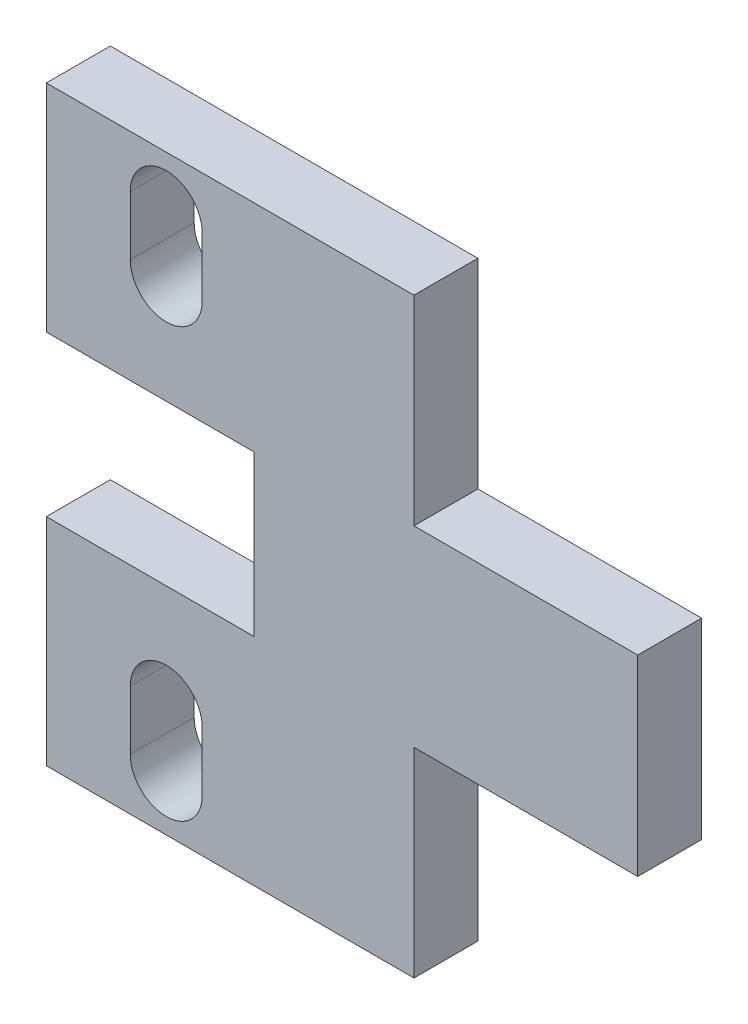
ISO-10303-21;
HEADER;
FILE_DESCRIPTION(('STEP AP214'),'2;1');
FILE_NAME('part.step','',(''),(''),'','','');
FILE_SCHEMA(('AUTOMOTIVE_DESIGN { 1 0 10303 214 1 1 1 1 }'));
ENDSEC;
DATA;
#1=APPLICATION_CONTEXT('core data for automotive mechanical design processes');
#2=APPLICATION_PROTOCOL_DEFINITION('international standard','automotive_design',2000,#1);
#3=PRODUCT_CONTEXT('',#1,'mechanical');
#4=PRODUCT('Part','Part','',(#3));
#5=PRODUCT_RELATED_PRODUCT_CATEGORY('part','',(#4));
#6=PRODUCT_DEFINITION_FORMATION('','',#4);
#7=PRODUCT_DEFINITION_CONTEXT('part definition',#1,'design');
#8=PRODUCT_DEFINITION('design','',#6,#7);
#9=PRODUCT_DEFINITION_SHAPE('','',#8);
#10=(LENGTH_UNIT() NAMED_UNIT(*) SI_UNIT(.MILLI.,.METRE.));
#11=(NAMED_UNIT(*) PLANE_ANGLE_UNIT() SI_UNIT($,.RADIAN.));
#12=(NAMED_UNIT(*) SI_UNIT($,.STERADIAN.) SOLID_ANGLE_UNIT());
#13=UNCERTAINTY_MEASURE_WITH_UNIT(LENGTH_MEASURE(1.E-05),#10,'distance_accuracy_value','');
#14=(GEOMETRIC_REPRESENTATION_CONTEXT(3) GLOBAL_UNCERTAINTY_ASSIGNED_CONTEXT((#13)) GLOBAL_UNIT_ASSIGNED_CONTEXT((#10,
#11,#12)) REPRESENTATION_CONTEXT('',''));
#15=CARTESIAN_POINT('',(0.,0.,0.));
#16=DIRECTION('',(0.,0.,1.));
#17=DIRECTION('',(1.,0.,0.));
#18=AXIS2_PLACEMENT_3D('',#15,#16,#17);
#19=CARTESIAN_POINT('',(0.,0.,2.));
#20=DIRECTION('',(0.,0.,1.));
#21=DIRECTION('',(1.,0.,0.));
#22=AXIS2_PLACEMENT_3D('',#19,#20,#21);
#23=PLANE('',#22);
#24=DIRECTION('',(0.,1.,0.));
#25=VECTOR('',#24,1.);
#26=CARTESIAN_POINT('',(-7.75,11.55,2.));
#27=LINE('',#26,#25);
#28=CARTESIAN_POINT('',(-7.74999999999997,11.55,2.));
#29=VERTEX_POINT('',#28);
#30=CARTESIAN_POINT('',(-7.75,15.25,2.));
#31=VERTEX_POINT('',#30);
#32=EDGE_CURVE('E331',#29,#31,#27,.T.);
#33=ORIENTED_EDGE('',*,*,#32,.T.);
#34=CARTESIAN_POINT('',(-5.5,15.25,2.));
#35=DIRECTION('',(0.,0.,1.));
#36=DIRECTION('',(1.,0.,0.));
#37=AXIS2_PLACEMENT_3D('',#34,#35,#36);
#38=CIRCLE('',#37,2.25);
#39=CARTESIAN_POINT('',(-3.24999999999995,15.25,2.));
#40=VERTEX_POINT('',#39);
#41=EDGE_CURVE('E342',#40,#31,#38,.T.);
#42=ORIENTED_EDGE('',*,*,#41,.F.);
#43=DIRECTION('',(0.,1.,0.));
#44=VECTOR('',#43,1.);
#45=CARTESIAN_POINT('',(-3.24999999999995,11.55,2.));
#46=LINE('',#45,#44);
#47=CARTESIAN_POINT('',(-3.25,11.55,2.));
#48=VERTEX_POINT('',#47);
#49=EDGE_CURVE('E325',#48,#40,#46,.T.);
#50=ORIENTED_EDGE('',*,*,#49,.F.);
#51=CARTESIAN_POINT('',(-5.5,11.55,2.));
#52=DIRECTION('',(0.,0.,1.));
#53=DIRECTION('',(1.,0.,0.));
#54=AXIS2_PLACEMENT_3D('',#51,#52,#53);
#55=CIRCLE('',#54,2.25);
#56=EDGE_CURVE('E329',#29,#48,#55,.T.);
#57=ORIENTED_EDGE('',*,*,#56,.F.);
#58=EDGE_LOOP('',(#33,#42,#50,#57));
#59=FACE_BOUND('',#58,.T.);
#60=DIRECTION('',(0.,1.,0.));
#61=VECTOR('',#60,1.);
#62=CARTESIAN_POINT('',(24.,-6.,2.));
#63=LINE('',#62,#61);
#64=CARTESIAN_POINT('',(24.,-6.,2.));
#65=VERTEX_POINT('',#64);
#66=CARTESIAN_POINT('',(24.,6.,2.));
#67=VERTEX_POINT('',#66);
#68=EDGE_CURVE('E438',#65,#67,#63,.T.);
#69=ORIENTED_EDGE('',*,*,#68,.T.);
#70=DIRECTION('',(1.,0.,0.));
#71=VECTOR('',#70,1.);
#72=CARTESIAN_POINT('',(10.,6.,2.));
#73=LINE('',#72,#71);
#74=CARTESIAN_POINT('',(10.,6.,2.));
#75=VERTEX_POINT('',#74);
#76=EDGE_CURVE('E350',#75,#67,#73,.T.);
#77=ORIENTED_EDGE('',*,*,#76,.F.);
#78=DIRECTION('',(0.,-1.,0.));
#79=VECTOR('',#78,1.);
#80=CARTESIAN_POINT('',(10.,18.5,2.));
#81=LINE('',#80,#79);
#82=CARTESIAN_POINT('',(10.,18.5,2.));
#83=VERTEX_POINT('',#82);
#84=EDGE_CURVE('E353',#83,#75,#81,.T.);
#85=ORIENTED_EDGE('',*,*,#84,.F.);
#86=DIRECTION('',(1.,0.,0.));
#87=VECTOR('',#86,1.);
#88=CARTESIAN_POINT('',(-13.,18.5,2.));
#89=LINE('',#88,#87);
#90=CARTESIAN_POINT('',(-13.,18.5,2.));
#91=VERTEX_POINT('',#90);
#92=EDGE_CURVE('E357',#91,#83,#89,.T.);
#93=ORIENTED_EDGE('',*,*,#92,.F.);
#94=DIRECTION('',(0.,1.,0.));
#95=VECTOR('',#94,1.);
#96=CARTESIAN_POINT('',(-13.,5.,2.));
#97=LINE('',#96,#95);
#98=CARTESIAN_POINT('',(-13.,5.,2.));
#99=VERTEX_POINT('',#98);
#100=EDGE_CURVE('E360',#99,#91,#97,.T.);
#101=ORIENTED_EDGE('',*,*,#100,.F.);
#102=DIRECTION('',(-1.,0.,0.));
#103=VECTOR('',#102,1.);
#104=CARTESIAN_POINT('',(0.,5.,2.));
#105=LINE('',#104,#103);
#106=CARTESIAN_POINT('',(0.,5.,2.));
#107=VERTEX_POINT('',#106);
#108=EDGE_CURVE('E363',#107,#99,#105,.T.);
#109=ORIENTED_EDGE('',*,*,#108,.F.);
#110=DIRECTION('',(0.,-1.,0.));
#111=VECTOR('',#110,1.);
#112=CARTESIAN_POINT('',(0.,0.,2.));
#113=LINE('',#112,#111);
#114=CARTESIAN_POINT('',(0.,-5.,2.));
#115=VERTEX_POINT('',#114);
#116=EDGE_CURVE('E425',#107,#115,#113,.T.);
#117=ORIENTED_EDGE('',*,*,#116,.T.);
#118=DIRECTION('',(-1.,0.,0.));
#119=VECTOR('',#118,1.);
#120=CARTESIAN_POINT('',(0.,-5.,2.));
#121=LINE('',#120,#119);
#122=CARTESIAN_POINT('',(-13.,-5.,2.));
#123=VERTEX_POINT('',#122);
#124=EDGE_CURVE('E427',#115,#123,#121,.T.);
#125=ORIENTED_EDGE('',*,*,#124,.T.);
#126=DIRECTION('',(0.,-1.,0.));
#127=VECTOR('',#126,1.);
#128=CARTESIAN_POINT('',(-13.,-5.,2.));
#129=LINE('',#128,#127);
#130=CARTESIAN_POINT('',(-13.,-18.5,2.));
#131=VERTEX_POINT('',#130);
#132=EDGE_CURVE('E430',#123,#131,#129,.T.);
#133=ORIENTED_EDGE('',*,*,#132,.T.);
#134=DIRECTION('',(1.,0.,0.));
#135=VECTOR('',#134,1.);
#136=CARTESIAN_POINT('',(-13.,-18.5,2.));
#137=LINE('',#136,#135);
#138=CARTESIAN_POINT('',(10.,-18.5,2.));
#139=VERTEX_POINT('',#138);
#140=EDGE_CURVE('E432',#131,#139,#137,.T.);
#141=ORIENTED_EDGE('',*,*,#140,.T.);
#142=DIRECTION('',(0.,1.,0.));
#143=VECTOR('',#142,1.);
#144=CARTESIAN_POINT('',(10.,-18.5,2.));
#145=LINE('',#144,#143);
#146=CARTESIAN_POINT('',(10.,-6.,2.));
#147=VERTEX_POINT('',#146);
#148=EDGE_CURVE('E434',#139,#147,#145,.T.);
#149=ORIENTED_EDGE('',*,*,#148,.T.);
#150=DIRECTION('',(1.,0.,0.));
#151=VECTOR('',#150,1.);
#152=CARTESIAN_POINT('',(10.,-6.,2.));
#153=LINE('',#152,#151);
#154=EDGE_CURVE('E436',#147,#65,#153,.T.);
#155=ORIENTED_EDGE('',*,*,#154,.T.);
#156=EDGE_LOOP('',(#69,#77,#85,#93,#101,#109,#117,#125,#133,#141,#149,#155));
#157=FACE_BOUND('',#156,.T.);
#158=CARTESIAN_POINT('',(-5.5,-11.55,2.));
#159=DIRECTION('',(0.,0.,1.));
#160=DIRECTION('',(1.,0.,0.));
#161=AXIS2_PLACEMENT_3D('',#158,#159,#160);
#162=CIRCLE('',#161,2.25);
#163=CARTESIAN_POINT('',(-3.25,-11.55,2.));
#164=VERTEX_POINT('',#163);
#165=CARTESIAN_POINT('',(-7.75,-11.55,2.));
#166=VERTEX_POINT('',#165);
#167=EDGE_CURVE('E407',#164,#166,#162,.T.);
#168=ORIENTED_EDGE('',*,*,#167,.F.);
#169=DIRECTION('',(0.,-1.,0.));
#170=VECTOR('',#169,1.);
#171=CARTESIAN_POINT('',(-3.25,-11.55,2.));
#172=LINE('',#171,#170);
#173=CARTESIAN_POINT('',(-3.25,-15.25,2.));
#174=VERTEX_POINT('',#173);
#175=EDGE_CURVE('E401',#164,#174,#172,.T.);
#176=ORIENTED_EDGE('',*,*,#175,.T.);
#177=CARTESIAN_POINT('',(-5.5,-15.25,2.));
#178=DIRECTION('',(0.,0.,1.));
#179=DIRECTION('',(1.,0.,0.));
#180=AXIS2_PLACEMENT_3D('',#177,#178,#179);
#181=CIRCLE('',#180,2.25);
#182=CARTESIAN_POINT('',(-7.75000000000006,-15.25,2.));
#183=VERTEX_POINT('',#182);
#184=EDGE_CURVE('E417',#183,#174,#181,.T.);
#185=ORIENTED_EDGE('',*,*,#184,.F.);
#186=DIRECTION('',(0.,-1.,0.));
#187=VECTOR('',#186,1.);
#188=CARTESIAN_POINT('',(-7.75000000000006,-11.55,2.));
#189=LINE('',#188,#187);
#190=EDGE_CURVE('E393',#166,#183,#189,.T.);
#191=ORIENTED_EDGE('',*,*,#190,.F.);
#192=EDGE_LOOP('',(#168,#176,#185,#191));
#193=FACE_BOUND('',#192,.T.);
#194=ADVANCED_FACE('F181',(#59,#157,#193),#23,.T.);
#195=CARTESIAN_POINT('',(0.,0.,2.));
#196=DIRECTION('',(1.,0.,0.));
#197=DIRECTION('',(0.,1.,0.));
#198=AXIS2_PLACEMENT_3D('',#195,#196,#197);
#199=PLANE('',#198);
#200=DIRECTION('',(0.,-1.,0.));
#201=VECTOR('',#200,1.);
#202=CARTESIAN_POINT('',(0.,0.,-2.));
#203=LINE('',#202,#201);
#204=CARTESIAN_POINT('',(0.,5.,-2.));
#205=VERTEX_POINT('',#204);
#206=CARTESIAN_POINT('',(0.,-5.,-2.));
#207=VERTEX_POINT('',#206);
#208=EDGE_CURVE('E424',#205,#207,#203,.T.);
#209=ORIENTED_EDGE('',*,*,#208,.T.);
#210=DIRECTION('',(0.,0.,-1.));
#211=VECTOR('',#210,1.);
#212=CARTESIAN_POINT('',(0.,-5.,2.));
#213=LINE('',#212,#211);
#214=EDGE_CURVE('E13',#115,#207,#213,.T.);
#215=ORIENTED_EDGE('',*,*,#214,.F.);
#216=ORIENTED_EDGE('',*,*,#116,.F.);
#217=DIRECTION('',(0.,0.,-1.));
#218=VECTOR('',#217,1.);
#219=CARTESIAN_POINT('',(0.,5.,2.));
#220=LINE('',#219,#218);
#221=EDGE_CURVE('E366',#107,#205,#220,.T.);
#222=ORIENTED_EDGE('',*,*,#221,.T.);
#223=EDGE_LOOP('',(#209,#215,#216,#222));
#224=FACE_BOUND('',#223,.T.);
#225=ADVANCED_FACE('F183',(#224),#199,.F.);
#226=CARTESIAN_POINT('',(0.,-5.,2.));
#227=DIRECTION('',(0.,-1.,0.));
#228=DIRECTION('',(1.,0.,0.));
#229=AXIS2_PLACEMENT_3D('',#226,#227,#228);
#230=PLANE('',#229);
#231=DIRECTION('',(-1.,0.,0.));
#232=VECTOR('',#231,1.);
#233=CARTESIAN_POINT('',(0.,-5.,-2.));
#234=LINE('',#233,#232);
#235=CARTESIAN_POINT('',(-13.,-5.,-2.));
#236=VERTEX_POINT('',#235);
#237=EDGE_CURVE('E442',#207,#236,#234,.T.);
#238=ORIENTED_EDGE('',*,*,#237,.T.);
#239=DIRECTION('',(0.,0.,-1.));
#240=VECTOR('',#239,1.);
#241=CARTESIAN_POINT('',(-13.,-5.,2.));
#242=LINE('',#241,#240);
#243=EDGE_CURVE('E189',#123,#236,#242,.T.);
#244=ORIENTED_EDGE('',*,*,#243,.F.);
#245=ORIENTED_EDGE('',*,*,#124,.F.);
#246=ORIENTED_EDGE('',*,*,#214,.T.);
#247=EDGE_LOOP('',(#238,#244,#245,#246));
#248=FACE_BOUND('',#247,.T.);
#249=ADVANCED_FACE('F491',(#248),#230,.F.);
#250=CARTESIAN_POINT('',(-13.,-5.,2.));
#251=DIRECTION('',(1.,0.,0.));
#252=DIRECTION('',(0.,1.,0.));
#253=AXIS2_PLACEMENT_3D('',#250,#251,#252);
#254=PLANE('',#253);
#255=DIRECTION('',(0.,-1.,0.));
#256=VECTOR('',#255,1.);
#257=CARTESIAN_POINT('',(-13.,-5.,-2.));
#258=LINE('',#257,#256);
#259=CARTESIAN_POINT('',(-13.,-18.5,-2.));
#260=VERTEX_POINT('',#259);
#261=EDGE_CURVE('E444',#236,#260,#258,.T.);
#262=ORIENTED_EDGE('',*,*,#261,.T.);
#263=DIRECTION('',(0.,0.,-1.));
#264=VECTOR('',#263,1.);
#265=CARTESIAN_POINT('',(-13.,-18.5,2.));
#266=LINE('',#265,#264);
#267=EDGE_CURVE('E461',#131,#260,#266,.T.);
#268=ORIENTED_EDGE('',*,*,#267,.F.);
#269=ORIENTED_EDGE('',*,*,#132,.F.);
#270=ORIENTED_EDGE('',*,*,#243,.T.);
#271=EDGE_LOOP('',(#262,#268,#269,#270));
#272=FACE_BOUND('',#271,.T.);
#273=ADVANCED_FACE('F468',(#272),#254,.F.);
#274=CARTESIAN_POINT('',(-13.,-18.5,2.));
#275=DIRECTION('',(0.,1.,0.));
#276=DIRECTION('',(-1.,0.,0.));
#277=AXIS2_PLACEMENT_3D('',#274,#275,#276);
#278=PLANE('',#277);
#279=DIRECTION('',(1.,0.,0.));
#280=VECTOR('',#279,1.);
#281=CARTESIAN_POINT('',(-13.,-18.5,-2.));
#282=LINE('',#281,#280);
#283=CARTESIAN_POINT('',(10.,-18.5,-2.));
#284=VERTEX_POINT('',#283);
#285=EDGE_CURVE('E446',#260,#284,#282,.T.);
#286=ORIENTED_EDGE('',*,*,#285,.T.);
#287=DIRECTION('',(0.,0.,-1.));
#288=VECTOR('',#287,1.);
#289=CARTESIAN_POINT('',(10.,-18.5,2.));
#290=LINE('',#289,#288);
#291=EDGE_CURVE('E458',#139,#284,#290,.T.);
#292=ORIENTED_EDGE('',*,*,#291,.F.);
#293=ORIENTED_EDGE('',*,*,#140,.F.);
#294=ORIENTED_EDGE('',*,*,#267,.T.);
#295=EDGE_LOOP('',(#286,#292,#293,#294));
#296=FACE_BOUND('',#295,.T.);
#297=ADVANCED_FACE('F479',(#296),#278,.F.);
#298=CARTESIAN_POINT('',(10.,-18.5,2.));
#299=DIRECTION('',(-1.,0.,0.));
#300=DIRECTION('',(0.,-1.,0.));
#301=AXIS2_PLACEMENT_3D('',#298,#299,#300);
#302=PLANE('',#301);
#303=DIRECTION('',(0.,1.,0.));
#304=VECTOR('',#303,1.);
#305=CARTESIAN_POINT('',(10.,-18.5,-2.));
#306=LINE('',#305,#304);
#307=CARTESIAN_POINT('',(10.,-6.,-2.));
#308=VERTEX_POINT('',#307);
#309=EDGE_CURVE('E448',#284,#308,#306,.T.);
#310=ORIENTED_EDGE('',*,*,#309,.T.);
#311=DIRECTION('',(0.,0.,-1.));
#312=VECTOR('',#311,1.);
#313=CARTESIAN_POINT('',(10.,-6.,2.));
#314=LINE('',#313,#312);
#315=EDGE_CURVE('E455',#147,#308,#314,.T.);
#316=ORIENTED_EDGE('',*,*,#315,.F.);
#317=ORIENTED_EDGE('',*,*,#148,.F.);
#318=ORIENTED_EDGE('',*,*,#291,.T.);
#319=EDGE_LOOP('',(#310,#316,#317,#318));
#320=FACE_BOUND('',#319,.T.);
#321=ADVANCED_FACE('F483',(#320),#302,.F.);
#322=CARTESIAN_POINT('',(10.,-6.,2.));
#323=DIRECTION('',(0.,1.,0.));
#324=DIRECTION('',(-1.,0.,0.));
#325=AXIS2_PLACEMENT_3D('',#322,#323,#324);
#326=PLANE('',#325);
#327=DIRECTION('',(1.,0.,0.));
#328=VECTOR('',#327,1.);
#329=CARTESIAN_POINT('',(10.,-6.,-2.));
#330=LINE('',#329,#328);
#331=CARTESIAN_POINT('',(24.,-6.,-2.));
#332=VERTEX_POINT('',#331);
#333=EDGE_CURVE('E450',#308,#332,#330,.T.);
#334=ORIENTED_EDGE('',*,*,#333,.T.);
#335=DIRECTION('',(0.,0.,-1.));
#336=VECTOR('',#335,1.);
#337=CARTESIAN_POINT('',(24.,-6.,2.));
#338=LINE('',#337,#336);
#339=EDGE_CURVE('E440',#65,#332,#338,.T.);
#340=ORIENTED_EDGE('',*,*,#339,.F.);
#341=ORIENTED_EDGE('',*,*,#154,.F.);
#342=ORIENTED_EDGE('',*,*,#315,.T.);
#343=EDGE_LOOP('',(#334,#340,#341,#342));
#344=FACE_BOUND('',#343,.T.);
#345=ADVANCED_FACE('F519',(#344),#326,.F.);
#346=CARTESIAN_POINT('',(24.,-6.,2.));
#347=DIRECTION('',(-1.,0.,0.));
#348=DIRECTION('',(0.,0.,1.));
#349=AXIS2_PLACEMENT_3D('',#346,#347,#348);
#350=PLANE('',#349);
#351=DIRECTION('',(0.,1.,0.));
#352=VECTOR('',#351,1.);
#353=CARTESIAN_POINT('',(24.,-6.,-2.));
#354=LINE('',#353,#352);
#355=CARTESIAN_POINT('',(24.,6.,-2.));
#356=VERTEX_POINT('',#355);
#357=EDGE_CURVE('E428',#332,#356,#354,.T.);
#358=ORIENTED_EDGE('',*,*,#357,.T.);
#359=DIRECTION('',(0.,0.,-1.));
#360=VECTOR('',#359,1.);
#361=CARTESIAN_POINT('',(24.,6.,2.));
#362=LINE('',#361,#360);
#363=EDGE_CURVE('E390',#67,#356,#362,.T.);
#364=ORIENTED_EDGE('',*,*,#363,.F.);
#365=ORIENTED_EDGE('',*,*,#68,.F.);
#366=ORIENTED_EDGE('',*,*,#339,.T.);
#367=EDGE_LOOP('',(#358,#364,#365,#366));
#368=FACE_BOUND('',#367,.T.);
#369=ADVANCED_FACE('F517',(#368),#350,.F.);
#370=CARTESIAN_POINT('',(0.,0.,-2.));
#371=DIRECTION('',(0.,0.,1.));
#372=DIRECTION('',(1.,0.,0.));
#373=AXIS2_PLACEMENT_3D('',#370,#371,#372);
#374=PLANE('',#373);
#375=CARTESIAN_POINT('',(-5.5,11.55,-2.));
#376=DIRECTION('',(0.,0.,1.));
#377=DIRECTION('',(1.,0.,0.));
#378=AXIS2_PLACEMENT_3D('',#375,#376,#377);
#379=CIRCLE('',#378,2.25);
#380=CARTESIAN_POINT('',(-7.75,11.55,-2.));
#381=VERTEX_POINT('',#380);
#382=CARTESIAN_POINT('',(-3.25,11.55,-2.));
#383=VERTEX_POINT('',#382);
#384=EDGE_CURVE('E203',#381,#383,#379,.T.);
#385=ORIENTED_EDGE('',*,*,#384,.T.);
#386=DIRECTION('',(0.,1.,0.));
#387=VECTOR('',#386,1.);
#388=CARTESIAN_POINT('',(-3.25,11.55,-2.));
#389=LINE('',#388,#387);
#390=CARTESIAN_POINT('',(-3.25,15.25,-2.));
#391=VERTEX_POINT('',#390);
#392=EDGE_CURVE('E318',#383,#391,#389,.T.);
#393=ORIENTED_EDGE('',*,*,#392,.T.);
#394=CARTESIAN_POINT('',(-5.5,15.25,-2.));
#395=DIRECTION('',(0.,0.,1.));
#396=DIRECTION('',(1.,0.,0.));
#397=AXIS2_PLACEMENT_3D('',#394,#395,#396);
#398=CIRCLE('',#397,2.25);
#399=CARTESIAN_POINT('',(-7.75,15.25,-2.));
#400=VERTEX_POINT('',#399);
#401=EDGE_CURVE('E345',#391,#400,#398,.T.);
#402=ORIENTED_EDGE('',*,*,#401,.T.);
#403=DIRECTION('',(0.,1.,0.));
#404=VECTOR('',#403,1.);
#405=CARTESIAN_POINT('',(-7.75,11.55,-2.));
#406=LINE('',#405,#404);
#407=EDGE_CURVE('E324',#381,#400,#406,.T.);
#408=ORIENTED_EDGE('',*,*,#407,.F.);
#409=EDGE_LOOP('',(#385,#393,#402,#408));
#410=FACE_BOUND('',#409,.T.);
#411=DIRECTION('',(0.,-1.,0.));
#412=VECTOR('',#411,1.);
#413=CARTESIAN_POINT('',(-7.75,-11.55,-2.));
#414=LINE('',#413,#412);
#415=CARTESIAN_POINT('',(-7.75,-11.55,-2.));
#416=VERTEX_POINT('',#415);
#417=CARTESIAN_POINT('',(-7.75,-15.25,-2.));
#418=VERTEX_POINT('',#417);
#419=EDGE_CURVE('E395',#416,#418,#414,.T.);
#420=ORIENTED_EDGE('',*,*,#419,.T.);
#421=CARTESIAN_POINT('',(-5.5,-15.25,-2.));
#422=DIRECTION('',(0.,0.,1.));
#423=DIRECTION('',(1.,0.,0.));
#424=AXIS2_PLACEMENT_3D('',#421,#422,#423);
#425=CIRCLE('',#424,2.25);
#426=CARTESIAN_POINT('',(-3.25,-15.25,-2.));
#427=VERTEX_POINT('',#426);
#428=EDGE_CURVE('E419',#418,#427,#425,.T.);
#429=ORIENTED_EDGE('',*,*,#428,.T.);
#430=DIRECTION('',(0.,-1.,0.));
#431=VECTOR('',#430,1.);
#432=CARTESIAN_POINT('',(-3.25,-11.55,-2.));
#433=LINE('',#432,#431);
#434=CARTESIAN_POINT('',(-3.25,-11.55,-2.));
#435=VERTEX_POINT('',#434);
#436=EDGE_CURVE('E398',#435,#427,#433,.T.);
#437=ORIENTED_EDGE('',*,*,#436,.F.);
#438=CARTESIAN_POINT('',(-5.5,-11.55,-2.));
#439=DIRECTION('',(0.,0.,1.));
#440=DIRECTION('',(1.,0.,0.));
#441=AXIS2_PLACEMENT_3D('',#438,#439,#440);
#442=CIRCLE('',#441,2.25);
#443=EDGE_CURVE('E409',#435,#416,#442,.T.);
#444=ORIENTED_EDGE('',*,*,#443,.T.);
#445=EDGE_LOOP('',(#420,#429,#437,#444));
#446=FACE_BOUND('',#445,.T.);
#447=ORIENTED_EDGE('',*,*,#208,.F.);
#448=DIRECTION('',(-1.,0.,0.));
#449=VECTOR('',#448,1.);
#450=CARTESIAN_POINT('',(0.,5.,-2.));
#451=LINE('',#450,#449);
#452=CARTESIAN_POINT('',(-13.,5.,-2.));
#453=VERTEX_POINT('',#452);
#454=EDGE_CURVE('E354',#205,#453,#451,.T.);
#455=ORIENTED_EDGE('',*,*,#454,.T.);
#456=DIRECTION('',(0.,1.,0.));
#457=VECTOR('',#456,1.);
#458=CARTESIAN_POINT('',(-13.,5.,-2.));
#459=LINE('',#458,#457);
#460=CARTESIAN_POINT('',(-13.,18.5,-2.));
#461=VERTEX_POINT('',#460);
#462=EDGE_CURVE('E375',#453,#461,#459,.T.);
#463=ORIENTED_EDGE('',*,*,#462,.T.);
#464=DIRECTION('',(1.,0.,0.));
#465=VECTOR('',#464,1.);
#466=CARTESIAN_POINT('',(-13.,18.5,-2.));
#467=LINE('',#466,#465);
#468=CARTESIAN_POINT('',(10.,18.5,-2.));
#469=VERTEX_POINT('',#468);
#470=EDGE_CURVE('E372',#461,#469,#467,.T.);
#471=ORIENTED_EDGE('',*,*,#470,.T.);
#472=DIRECTION('',(0.,-1.,0.));
#473=VECTOR('',#472,1.);
#474=CARTESIAN_POINT('',(10.,18.5,-2.));
#475=LINE('',#474,#473);
#476=CARTESIAN_POINT('',(10.,6.,-2.));
#477=VERTEX_POINT('',#476);
#478=EDGE_CURVE('E369',#469,#477,#475,.T.);
#479=ORIENTED_EDGE('',*,*,#478,.T.);
#480=DIRECTION('',(1.,0.,0.));
#481=VECTOR('',#480,1.);
#482=CARTESIAN_POINT('',(10.,6.,-2.));
#483=LINE('',#482,#481);
#484=EDGE_CURVE('E349',#477,#356,#483,.T.);
#485=ORIENTED_EDGE('',*,*,#484,.T.);
#486=ORIENTED_EDGE('',*,*,#357,.F.);
#487=ORIENTED_EDGE('',*,*,#333,.F.);
#488=ORIENTED_EDGE('',*,*,#309,.F.);
#489=ORIENTED_EDGE('',*,*,#285,.F.);
#490=ORIENTED_EDGE('',*,*,#261,.F.);
#491=ORIENTED_EDGE('',*,*,#237,.F.);
#492=EDGE_LOOP('',(#447,#455,#463,#471,#479,#485,#486,#487,#488,#489,#490,#491));
#493=FACE_BOUND('',#492,.T.);
#494=ADVANCED_FACE('F334',(#410,#446,#493),#374,.F.);
#495=CARTESIAN_POINT('',(-5.5,-15.25,2.));
#496=DIRECTION('',(0.,0.,1.));
#497=DIRECTION('',(1.,0.,0.));
#498=AXIS2_PLACEMENT_3D('',#495,#496,#497);
#499=CYLINDRICAL_SURFACE('',#498,2.25);
#500=ORIENTED_EDGE('',*,*,#184,.T.);
#501=DIRECTION('',(0.,0.,-1.));
#502=VECTOR('',#501,1.);
#503=CARTESIAN_POINT('',(-3.25,-15.25,-2.));
#504=LINE('',#503,#502);
#505=EDGE_CURVE('E415',#174,#427,#504,.T.);
#506=ORIENTED_EDGE('',*,*,#505,.T.);
#507=ORIENTED_EDGE('',*,*,#428,.F.);
#508=DIRECTION('',(0.,0.,1.));
#509=VECTOR('',#508,1.);
#510=CARTESIAN_POINT('',(-7.75,-15.25,2.));
#511=LINE('',#510,#509);
#512=EDGE_CURVE('E422',#183,#418,#511,.F.);
#513=ORIENTED_EDGE('',*,*,#512,.F.);
#514=EDGE_LOOP('',(#500,#506,#507,#513));
#515=FACE_BOUND('',#514,.T.);
#516=ADVANCED_FACE('F537',(#515),#499,.F.);
#517=CARTESIAN_POINT('',(-5.5,-11.55,2.));
#518=DIRECTION('',(0.,0.,1.));
#519=DIRECTION('',(1.,0.,0.));
#520=AXIS2_PLACEMENT_3D('',#517,#518,#519);
#521=CYLINDRICAL_SURFACE('',#520,2.25);
#522=ORIENTED_EDGE('',*,*,#443,.F.);
#523=DIRECTION('',(0.,0.,-1.));
#524=VECTOR('',#523,1.);
#525=CARTESIAN_POINT('',(-3.25,-11.55,-2.));
#526=LINE('',#525,#524);
#527=EDGE_CURVE('E404',#164,#435,#526,.T.);
#528=ORIENTED_EDGE('',*,*,#527,.F.);
#529=ORIENTED_EDGE('',*,*,#167,.T.);
#530=DIRECTION('',(0.,0.,1.));
#531=VECTOR('',#530,1.);
#532=CARTESIAN_POINT('',(-7.75,-11.55,2.));
#533=LINE('',#532,#531);
#534=EDGE_CURVE('E412',#416,#166,#533,.T.);
#535=ORIENTED_EDGE('',*,*,#534,.F.);
#536=EDGE_LOOP('',(#522,#528,#529,#535));
#537=FACE_BOUND('',#536,.T.);
#538=ADVANCED_FACE('F543',(#537),#521,.F.);
#539=CARTESIAN_POINT('',(-3.25,-11.55,-2.));
#540=DIRECTION('',(-1.,0.,0.));
#541=DIRECTION('',(0.,0.,1.));
#542=AXIS2_PLACEMENT_3D('',#539,#540,#541);
#543=PLANE('',#542);
#544=ORIENTED_EDGE('',*,*,#505,.F.);
#545=ORIENTED_EDGE('',*,*,#175,.F.);
#546=ORIENTED_EDGE('',*,*,#527,.T.);
#547=ORIENTED_EDGE('',*,*,#436,.T.);
#548=EDGE_LOOP('',(#544,#545,#546,#547));
#549=FACE_BOUND('',#548,.T.);
#550=ADVANCED_FACE('F548',(#549),#543,.T.);
#551=CARTESIAN_POINT('',(-7.75,-11.55,2.));
#552=DIRECTION('',(-1.,0.,0.));
#553=DIRECTION('',(0.,0.,1.));
#554=AXIS2_PLACEMENT_3D('',#551,#552,#553);
#555=PLANE('',#554);
#556=ORIENTED_EDGE('',*,*,#512,.T.);
#557=ORIENTED_EDGE('',*,*,#419,.F.);
#558=ORIENTED_EDGE('',*,*,#534,.T.);
#559=ORIENTED_EDGE('',*,*,#190,.T.);
#560=EDGE_LOOP('',(#556,#557,#558,#559));
#561=FACE_BOUND('',#560,.T.);
#562=ADVANCED_FACE('F561',(#561),#555,.F.);
#563=CARTESIAN_POINT('',(10.,6.,2.));
#564=DIRECTION('',(0.,1.,0.));
#565=DIRECTION('',(-1.,0.,0.));
#566=AXIS2_PLACEMENT_3D('',#563,#564,#565);
#567=PLANE('',#566);
#568=ORIENTED_EDGE('',*,*,#484,.F.);
#569=DIRECTION('',(0.,0.,-1.));
#570=VECTOR('',#569,1.);
#571=CARTESIAN_POINT('',(10.,6.,2.));
#572=LINE('',#571,#570);
#573=EDGE_CURVE('E388',#75,#477,#572,.T.);
#574=ORIENTED_EDGE('',*,*,#573,.F.);
#575=ORIENTED_EDGE('',*,*,#76,.T.);
#576=ORIENTED_EDGE('',*,*,#363,.T.);
#577=EDGE_LOOP('',(#568,#574,#575,#576));
#578=FACE_BOUND('',#577,.T.);
#579=ADVANCED_FACE('F513',(#578),#567,.T.);
#580=CARTESIAN_POINT('',(10.,18.5,2.));
#581=DIRECTION('',(1.,0.,0.));
#582=DIRECTION('',(0.,1.,0.));
#583=AXIS2_PLACEMENT_3D('',#580,#581,#582);
#584=PLANE('',#583);
#585=ORIENTED_EDGE('',*,*,#478,.F.);
#586=DIRECTION('',(0.,0.,-1.));
#587=VECTOR('',#586,1.);
#588=CARTESIAN_POINT('',(10.,18.5,2.));
#589=LINE('',#588,#587);
#590=EDGE_CURVE('E386',#83,#469,#589,.T.);
#591=ORIENTED_EDGE('',*,*,#590,.F.);
#592=ORIENTED_EDGE('',*,*,#84,.T.);
#593=ORIENTED_EDGE('',*,*,#573,.T.);
#594=EDGE_LOOP('',(#585,#591,#592,#593));
#595=FACE_BOUND('',#594,.T.);
#596=ADVANCED_FACE('F509',(#595),#584,.T.);
#597=CARTESIAN_POINT('',(-13.,18.5,2.));
#598=DIRECTION('',(0.,1.,0.));
#599=DIRECTION('',(-1.,0.,0.));
#600=AXIS2_PLACEMENT_3D('',#597,#598,#599);
#601=PLANE('',#600);
#602=ORIENTED_EDGE('',*,*,#470,.F.);
#603=DIRECTION('',(0.,0.,-1.));
#604=VECTOR('',#603,1.);
#605=CARTESIAN_POINT('',(-13.,18.5,2.));
#606=LINE('',#605,#604);
#607=EDGE_CURVE('E384',#91,#461,#606,.T.);
#608=ORIENTED_EDGE('',*,*,#607,.F.);
#609=ORIENTED_EDGE('',*,*,#92,.T.);
#610=ORIENTED_EDGE('',*,*,#590,.T.);
#611=EDGE_LOOP('',(#602,#608,#609,#610));
#612=FACE_BOUND('',#611,.T.);
#613=ADVANCED_FACE('F504',(#612),#601,.T.);
#614=CARTESIAN_POINT('',(-13.,5.,2.));
#615=DIRECTION('',(-1.,0.,0.));
#616=DIRECTION('',(0.,-1.,0.));
#617=AXIS2_PLACEMENT_3D('',#614,#615,#616);
#618=PLANE('',#617);
#619=ORIENTED_EDGE('',*,*,#462,.F.);
#620=DIRECTION('',(0.,0.,-1.));
#621=VECTOR('',#620,1.);
#622=CARTESIAN_POINT('',(-13.,5.,2.));
#623=LINE('',#622,#621);
#624=EDGE_CURVE('E382',#99,#453,#623,.T.);
#625=ORIENTED_EDGE('',*,*,#624,.F.);
#626=ORIENTED_EDGE('',*,*,#100,.T.);
#627=ORIENTED_EDGE('',*,*,#607,.T.);
#628=EDGE_LOOP('',(#619,#625,#626,#627));
#629=FACE_BOUND('',#628,.T.);
#630=ADVANCED_FACE('F500',(#629),#618,.T.);
#631=CARTESIAN_POINT('',(0.,5.,2.));
#632=DIRECTION('',(0.,-1.,0.));
#633=DIRECTION('',(1.,0.,0.));
#634=AXIS2_PLACEMENT_3D('',#631,#632,#633);
#635=PLANE('',#634);
#636=ORIENTED_EDGE('',*,*,#454,.F.);
#637=ORIENTED_EDGE('',*,*,#221,.F.);
#638=ORIENTED_EDGE('',*,*,#108,.T.);
#639=ORIENTED_EDGE('',*,*,#624,.T.);
#640=EDGE_LOOP('',(#636,#637,#638,#639));
#641=FACE_BOUND('',#640,.T.);
#642=ADVANCED_FACE('F497',(#641),#635,.T.);
#643=CARTESIAN_POINT('',(-5.5,15.25,2.));
#644=DIRECTION('',(0.,0.,1.));
#645=DIRECTION('',(1.,0.,0.));
#646=AXIS2_PLACEMENT_3D('',#643,#644,#645);
#647=CYLINDRICAL_SURFACE('',#646,2.25);
#648=ORIENTED_EDGE('',*,*,#401,.F.);
#649=DIRECTION('',(0.,0.,-1.));
#650=VECTOR('',#649,1.);
#651=CARTESIAN_POINT('',(-3.25,15.25,-2.));
#652=LINE('',#651,#650);
#653=EDGE_CURVE('E321',#40,#391,#652,.T.);
#654=ORIENTED_EDGE('',*,*,#653,.F.);
#655=ORIENTED_EDGE('',*,*,#41,.T.);
#656=DIRECTION('',(0.,0.,1.));
#657=VECTOR('',#656,1.);
#658=CARTESIAN_POINT('',(-7.75,15.25,2.));
#659=LINE('',#658,#657);
#660=EDGE_CURVE('E347',#400,#31,#659,.T.);
#661=ORIENTED_EDGE('',*,*,#660,.F.);
#662=EDGE_LOOP('',(#648,#654,#655,#661));
#663=FACE_BOUND('',#662,.T.);
#664=ADVANCED_FACE('F579',(#663),#647,.F.);
#665=CARTESIAN_POINT('',(-5.5,11.55,2.));
#666=DIRECTION('',(0.,0.,1.));
#667=DIRECTION('',(1.,0.,0.));
#668=AXIS2_PLACEMENT_3D('',#665,#666,#667);
#669=CYLINDRICAL_SURFACE('',#668,2.25);
#670=ORIENTED_EDGE('',*,*,#56,.T.);
#671=DIRECTION('',(0.,0.,-1.));
#672=VECTOR('',#671,1.);
#673=CARTESIAN_POINT('',(-3.25,11.55,-2.));
#674=LINE('',#673,#672);
#675=EDGE_CURVE('E196',#48,#383,#674,.T.);
#676=ORIENTED_EDGE('',*,*,#675,.T.);
#677=ORIENTED_EDGE('',*,*,#384,.F.);
#678=DIRECTION('',(0.,0.,1.));
#679=VECTOR('',#678,1.);
#680=CARTESIAN_POINT('',(-7.75,11.55,2.));
#681=LINE('',#680,#679);
#682=EDGE_CURVE('E336',#29,#381,#681,.F.);
#683=ORIENTED_EDGE('',*,*,#682,.F.);
#684=EDGE_LOOP('',(#670,#676,#677,#683));
#685=FACE_BOUND('',#684,.T.);
#686=ADVANCED_FACE('F327',(#685),#669,.F.);
#687=CARTESIAN_POINT('',(-7.75,11.55,2.));
#688=DIRECTION('',(-1.,0.,0.));
#689=DIRECTION('',(0.,0.,1.));
#690=AXIS2_PLACEMENT_3D('',#687,#688,#689);
#691=PLANE('',#690);
#692=ORIENTED_EDGE('',*,*,#660,.T.);
#693=ORIENTED_EDGE('',*,*,#32,.F.);
#694=ORIENTED_EDGE('',*,*,#682,.T.);
#695=ORIENTED_EDGE('',*,*,#407,.T.);
#696=EDGE_LOOP('',(#692,#693,#694,#695));
#697=FACE_BOUND('',#696,.T.);
#698=ADVANCED_FACE('F585',(#697),#691,.F.);
#699=CARTESIAN_POINT('',(-3.25,11.55,-2.));
#700=DIRECTION('',(1.,0.,0.));
#701=DIRECTION('',(0.,0.,-1.));
#702=AXIS2_PLACEMENT_3D('',#699,#700,#701);
#703=PLANE('',#702);
#704=ORIENTED_EDGE('',*,*,#653,.T.);
#705=ORIENTED_EDGE('',*,*,#392,.F.);
#706=ORIENTED_EDGE('',*,*,#675,.F.);
#707=ORIENTED_EDGE('',*,*,#49,.T.);
#708=EDGE_LOOP('',(#704,#705,#706,#707));
#709=FACE_BOUND('',#708,.T.);
#710=ADVANCED_FACE('F319',(#709),#703,.F.);
#711=CLOSED_SHELL('',(#194,#225,#249,#273,#297,#321,#345,#369,#494,#516,#538,#550,#562,#579,
#596,#613,#630,#642,#664,#686,#698,#710));
#712=MANIFOLD_SOLID_BREP('B2',#711);
#713=ADVANCED_BREP_SHAPE_REPRESENTATION('',(#18,#712),#14);
#714=SHAPE_DEFINITION_REPRESENTATION(#9,#713);
ENDSEC;
END-ISO-10303-21;
